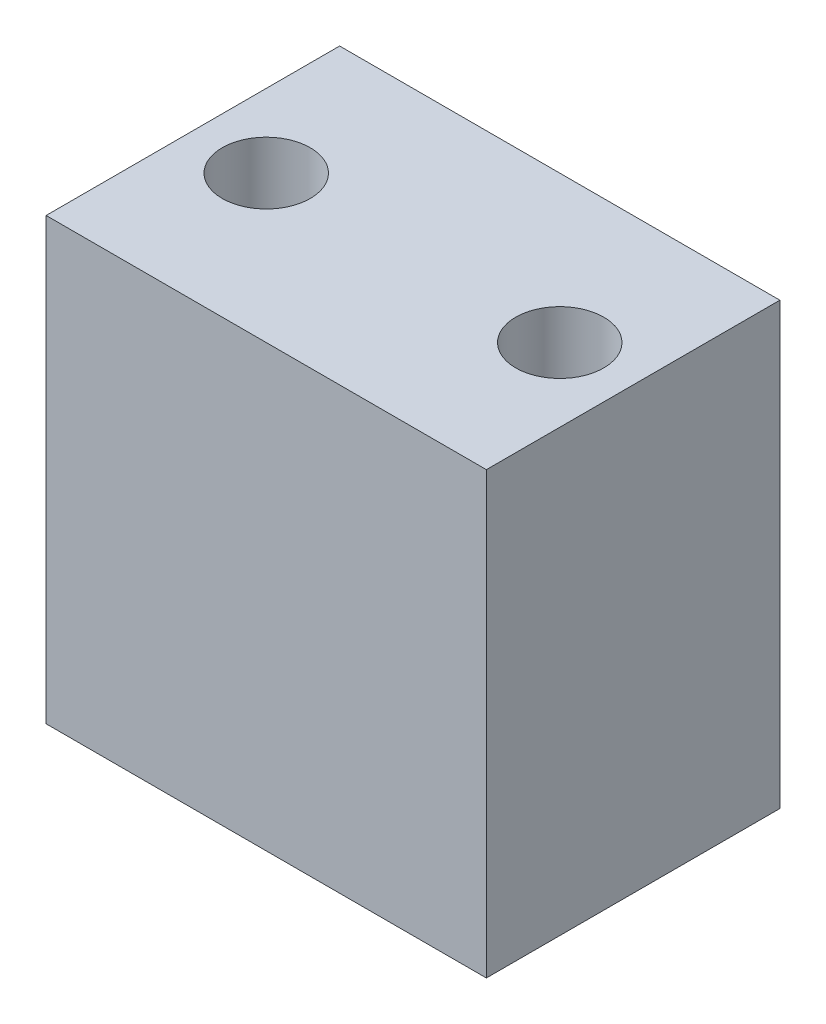
ISO-10303-21;
HEADER;
FILE_DESCRIPTION(('STEP AP214'),'2;1');
FILE_NAME('part.step','',(''),(''),'','','');
FILE_SCHEMA(('AUTOMOTIVE_DESIGN { 1 0 10303 214 1 1 1 1 }'));
ENDSEC;
DATA;
#1=APPLICATION_CONTEXT('core data for automotive mechanical design processes');
#2=APPLICATION_PROTOCOL_DEFINITION('international standard','automotive_design',2000,#1);
#3=PRODUCT_CONTEXT('',#1,'mechanical');
#4=PRODUCT('Part','Part','',(#3));
#5=PRODUCT_RELATED_PRODUCT_CATEGORY('part','',(#4));
#6=PRODUCT_DEFINITION_FORMATION('','',#4);
#7=PRODUCT_DEFINITION_CONTEXT('part definition',#1,'design');
#8=PRODUCT_DEFINITION('design','',#6,#7);
#9=PRODUCT_DEFINITION_SHAPE('','',#8);
#10=(LENGTH_UNIT() NAMED_UNIT(*) SI_UNIT(.MILLI.,.METRE.));
#11=(NAMED_UNIT(*) PLANE_ANGLE_UNIT() SI_UNIT($,.RADIAN.));
#12=(NAMED_UNIT(*) SI_UNIT($,.STERADIAN.) SOLID_ANGLE_UNIT());
#13=UNCERTAINTY_MEASURE_WITH_UNIT(LENGTH_MEASURE(1.E-05),#10,'distance_accuracy_value','');
#14=(GEOMETRIC_REPRESENTATION_CONTEXT(3) GLOBAL_UNCERTAINTY_ASSIGNED_CONTEXT((#13)) GLOBAL_UNIT_ASSIGNED_CONTEXT((#10,
#11,#12)) REPRESENTATION_CONTEXT('',''));
#15=CARTESIAN_POINT('',(0.,0.,0.));
#16=DIRECTION('',(0.,0.,1.));
#17=DIRECTION('',(1.,0.,0.));
#18=AXIS2_PLACEMENT_3D('',#15,#16,#17);
#19=CARTESIAN_POINT('',(0.,38.1,0.));
#20=DIRECTION('',(0.,1.,0.));
#21=DIRECTION('',(0.,0.,1.));
#22=AXIS2_PLACEMENT_3D('',#19,#20,#21);
#23=PLANE('',#22);
#24=CARTESIAN_POINT('',(-31.75,38.1,-12.7));
#25=DIRECTION('',(0.,1.,0.));
#26=DIRECTION('',(0.,0.,1.));
#27=AXIS2_PLACEMENT_3D('',#24,#25,#26);
#28=CIRCLE('',#27,3.81000000000001);
#29=CARTESIAN_POINT('',(-31.75,38.1,-8.88999999999998));
#30=VERTEX_POINT('',#29);
#31=EDGE_CURVE('E112',#30,#30,#28,.T.);
#32=ORIENTED_EDGE('',*,*,#31,.F.);
#33=EDGE_LOOP('',(#32));
#34=FACE_BOUND('',#33,.T.);
#35=DIRECTION('',(0.,0.,1.));
#36=VECTOR('',#35,1.);
#37=CARTESIAN_POINT('',(-38.1,38.1,-25.4));
#38=LINE('',#37,#36);
#39=CARTESIAN_POINT('',(-38.1,38.1,-25.4));
#40=VERTEX_POINT('',#39);
#41=CARTESIAN_POINT('',(-38.1,38.1,0.));
#42=VERTEX_POINT('',#41);
#43=EDGE_CURVE('E92',#40,#42,#38,.T.);
#44=ORIENTED_EDGE('',*,*,#43,.T.);
#45=DIRECTION('',(1.,0.,0.));
#46=VECTOR('',#45,1.);
#47=CARTESIAN_POINT('',(-38.1,38.1,0.));
#48=LINE('',#47,#46);
#49=CARTESIAN_POINT('',(0.,38.1,0.));
#50=VERTEX_POINT('',#49);
#51=EDGE_CURVE('E87',#42,#50,#48,.T.);
#52=ORIENTED_EDGE('',*,*,#51,.T.);
#53=DIRECTION('',(0.,0.,-1.));
#54=VECTOR('',#53,1.);
#55=CARTESIAN_POINT('',(0.,38.1,-25.4));
#56=LINE('',#55,#54);
#57=CARTESIAN_POINT('',(0.,38.1,-25.4));
#58=VERTEX_POINT('',#57);
#59=EDGE_CURVE('E90',#50,#58,#56,.T.);
#60=ORIENTED_EDGE('',*,*,#59,.T.);
#61=DIRECTION('',(-1.,0.,0.));
#62=VECTOR('',#61,1.);
#63=CARTESIAN_POINT('',(-38.1,38.1,-25.4));
#64=LINE('',#63,#62);
#65=EDGE_CURVE('E57',#58,#40,#64,.T.);
#66=ORIENTED_EDGE('',*,*,#65,.T.);
#67=EDGE_LOOP('',(#44,#52,#60,#66));
#68=FACE_BOUND('',#67,.T.);
#69=CARTESIAN_POINT('',(-6.35,38.1,-12.7));
#70=DIRECTION('',(0.,1.,0.));
#71=DIRECTION('',(0.,0.,1.));
#72=AXIS2_PLACEMENT_3D('',#69,#70,#71);
#73=CIRCLE('',#72,3.81);
#74=CARTESIAN_POINT('',(-6.35,38.1,-8.89));
#75=VERTEX_POINT('',#74);
#76=EDGE_CURVE('E134',#75,#75,#73,.T.);
#77=ORIENTED_EDGE('',*,*,#76,.F.);
#78=EDGE_LOOP('',(#77));
#79=FACE_BOUND('',#78,.T.);
#80=ADVANCED_FACE('F39',(#34,#68,#79),#23,.T.);
#81=CARTESIAN_POINT('',(0.,0.,0.));
#82=DIRECTION('',(0.,1.,0.));
#83=DIRECTION('',(0.,0.,1.));
#84=AXIS2_PLACEMENT_3D('',#81,#82,#83);
#85=PLANE('',#84);
#86=DIRECTION('',(0.,0.,1.));
#87=VECTOR('',#86,1.);
#88=CARTESIAN_POINT('',(-38.1,0.,-25.4));
#89=LINE('',#88,#87);
#90=CARTESIAN_POINT('',(-38.1,0.,-25.4));
#91=VERTEX_POINT('',#90);
#92=CARTESIAN_POINT('',(-38.1,0.,0.));
#93=VERTEX_POINT('',#92);
#94=EDGE_CURVE('E108',#91,#93,#89,.T.);
#95=ORIENTED_EDGE('',*,*,#94,.F.);
#96=DIRECTION('',(-1.,0.,0.));
#97=VECTOR('',#96,1.);
#98=CARTESIAN_POINT('',(-38.1,0.,-25.4));
#99=LINE('',#98,#97);
#100=CARTESIAN_POINT('',(0.,0.,-25.4));
#101=VERTEX_POINT('',#100);
#102=EDGE_CURVE('E80',#101,#91,#99,.T.);
#103=ORIENTED_EDGE('',*,*,#102,.F.);
#104=DIRECTION('',(0.,0.,-1.));
#105=VECTOR('',#104,1.);
#106=CARTESIAN_POINT('',(0.,0.,-25.4));
#107=LINE('',#106,#105);
#108=CARTESIAN_POINT('',(0.,0.,0.));
#109=VERTEX_POINT('',#108);
#110=EDGE_CURVE('E74',#109,#101,#107,.T.);
#111=ORIENTED_EDGE('',*,*,#110,.F.);
#112=DIRECTION('',(1.,0.,0.));
#113=VECTOR('',#112,1.);
#114=CARTESIAN_POINT('',(-38.1,0.,0.));
#115=LINE('',#114,#113);
#116=EDGE_CURVE('E97',#93,#109,#115,.T.);
#117=ORIENTED_EDGE('',*,*,#116,.F.);
#118=EDGE_LOOP('',(#95,#103,#111,#117));
#119=FACE_BOUND('',#118,.T.);
#120=CARTESIAN_POINT('',(-31.75,0.,-12.7));
#121=DIRECTION('',(0.,1.,0.));
#122=DIRECTION('',(0.,0.,1.));
#123=AXIS2_PLACEMENT_3D('',#120,#121,#122);
#124=CIRCLE('',#123,3.81000000000001);
#125=CARTESIAN_POINT('',(-31.75,0.,-8.88999999999998));
#126=VERTEX_POINT('',#125);
#127=EDGE_CURVE('E130',#126,#126,#124,.T.);
#128=ORIENTED_EDGE('',*,*,#127,.T.);
#129=EDGE_LOOP('',(#128));
#130=FACE_BOUND('',#129,.T.);
#131=CARTESIAN_POINT('',(-6.35,0.,-12.7));
#132=DIRECTION('',(0.,1.,0.));
#133=DIRECTION('',(0.,0.,1.));
#134=AXIS2_PLACEMENT_3D('',#131,#132,#133);
#135=CIRCLE('',#134,3.81);
#136=CARTESIAN_POINT('',(-6.35,0.,-8.89));
#137=VERTEX_POINT('',#136);
#138=EDGE_CURVE('E138',#137,#137,#135,.T.);
#139=ORIENTED_EDGE('',*,*,#138,.T.);
#140=EDGE_LOOP('',(#139));
#141=FACE_BOUND('',#140,.T.);
#142=ADVANCED_FACE('F125',(#119,#130,#141),#85,.F.);
#143=CARTESIAN_POINT('',(-38.1,38.1,-25.4));
#144=DIRECTION('',(1.,0.,0.));
#145=DIRECTION('',(0.,0.,-1.));
#146=AXIS2_PLACEMENT_3D('',#143,#144,#145);
#147=PLANE('',#146);
#148=ORIENTED_EDGE('',*,*,#94,.T.);
#149=DIRECTION('',(0.,-1.,0.));
#150=VECTOR('',#149,1.);
#151=CARTESIAN_POINT('',(-38.1,38.1,0.));
#152=LINE('',#151,#150);
#153=EDGE_CURVE('E11',#42,#93,#152,.T.);
#154=ORIENTED_EDGE('',*,*,#153,.F.);
#155=ORIENTED_EDGE('',*,*,#43,.F.);
#156=DIRECTION('',(0.,-1.,0.));
#157=VECTOR('',#156,1.);
#158=CARTESIAN_POINT('',(-38.1,38.1,-25.4));
#159=LINE('',#158,#157);
#160=EDGE_CURVE('E104',#40,#91,#159,.T.);
#161=ORIENTED_EDGE('',*,*,#160,.T.);
#162=EDGE_LOOP('',(#148,#154,#155,#161));
#163=FACE_BOUND('',#162,.T.);
#164=ADVANCED_FACE('F41',(#163),#147,.F.);
#165=CARTESIAN_POINT('',(-38.1,38.1,0.));
#166=DIRECTION('',(0.,0.,-1.));
#167=DIRECTION('',(-1.,0.,0.));
#168=AXIS2_PLACEMENT_3D('',#165,#166,#167);
#169=PLANE('',#168);
#170=ORIENTED_EDGE('',*,*,#116,.T.);
#171=DIRECTION('',(0.,-1.,0.));
#172=VECTOR('',#171,1.);
#173=CARTESIAN_POINT('',(0.,38.1,0.));
#174=LINE('',#173,#172);
#175=EDGE_CURVE('E49',#50,#109,#174,.T.);
#176=ORIENTED_EDGE('',*,*,#175,.F.);
#177=ORIENTED_EDGE('',*,*,#51,.F.);
#178=ORIENTED_EDGE('',*,*,#153,.T.);
#179=EDGE_LOOP('',(#170,#176,#177,#178));
#180=FACE_BOUND('',#179,.T.);
#181=ADVANCED_FACE('F96',(#180),#169,.F.);
#182=CARTESIAN_POINT('',(0.,38.1,-25.4));
#183=DIRECTION('',(-1.,0.,0.));
#184=DIRECTION('',(0.,0.,1.));
#185=AXIS2_PLACEMENT_3D('',#182,#183,#184);
#186=PLANE('',#185);
#187=ORIENTED_EDGE('',*,*,#110,.T.);
#188=DIRECTION('',(0.,-1.,0.));
#189=VECTOR('',#188,1.);
#190=CARTESIAN_POINT('',(0.,38.1,-25.4));
#191=LINE('',#190,#189);
#192=EDGE_CURVE('E99',#58,#101,#191,.T.);
#193=ORIENTED_EDGE('',*,*,#192,.F.);
#194=ORIENTED_EDGE('',*,*,#59,.F.);
#195=ORIENTED_EDGE('',*,*,#175,.T.);
#196=EDGE_LOOP('',(#187,#193,#194,#195));
#197=FACE_BOUND('',#196,.T.);
#198=ADVANCED_FACE('F100',(#197),#186,.F.);
#199=CARTESIAN_POINT('',(-38.1,38.1,-25.4));
#200=DIRECTION('',(0.,0.,1.));
#201=DIRECTION('',(1.,0.,0.));
#202=AXIS2_PLACEMENT_3D('',#199,#200,#201);
#203=PLANE('',#202);
#204=ORIENTED_EDGE('',*,*,#102,.T.);
#205=ORIENTED_EDGE('',*,*,#160,.F.);
#206=ORIENTED_EDGE('',*,*,#65,.F.);
#207=ORIENTED_EDGE('',*,*,#192,.T.);
#208=EDGE_LOOP('',(#204,#205,#206,#207));
#209=FACE_BOUND('',#208,.T.);
#210=ADVANCED_FACE('F122',(#209),#203,.F.);
#211=CARTESIAN_POINT('',(-31.75,38.1,-12.7));
#212=DIRECTION('',(0.,-1.,0.));
#213=DIRECTION('',(0.,0.,-1.));
#214=AXIS2_PLACEMENT_3D('',#211,#212,#213);
#215=CYLINDRICAL_SURFACE('',#214,3.81000000000001);
#216=ORIENTED_EDGE('',*,*,#31,.T.);
#217=EDGE_LOOP('',(#216));
#218=FACE_BOUND('',#217,.T.);
#219=ORIENTED_EDGE('',*,*,#127,.F.);
#220=EDGE_LOOP('',(#219));
#221=FACE_BOUND('',#220,.T.);
#222=ADVANCED_FACE('F157',(#218,#221),#215,.F.);
#223=CARTESIAN_POINT('',(-6.35,38.1,-12.7));
#224=DIRECTION('',(0.,-1.,0.));
#225=DIRECTION('',(0.,0.,-1.));
#226=AXIS2_PLACEMENT_3D('',#223,#224,#225);
#227=CYLINDRICAL_SURFACE('',#226,3.81);
#228=ORIENTED_EDGE('',*,*,#76,.T.);
#229=EDGE_LOOP('',(#228));
#230=FACE_BOUND('',#229,.T.);
#231=ORIENTED_EDGE('',*,*,#138,.F.);
#232=EDGE_LOOP('',(#231));
#233=FACE_BOUND('',#232,.T.);
#234=ADVANCED_FACE('F146',(#230,#233),#227,.F.);
#235=CLOSED_SHELL('',(#80,#142,#164,#181,#198,#210,#222,#234));
#236=MANIFOLD_SOLID_BREP('B2',#235);
#237=ADVANCED_BREP_SHAPE_REPRESENTATION('',(#18,#236),#14);
#238=SHAPE_DEFINITION_REPRESENTATION(#9,#237);
ENDSEC;
END-ISO-10303-21;
